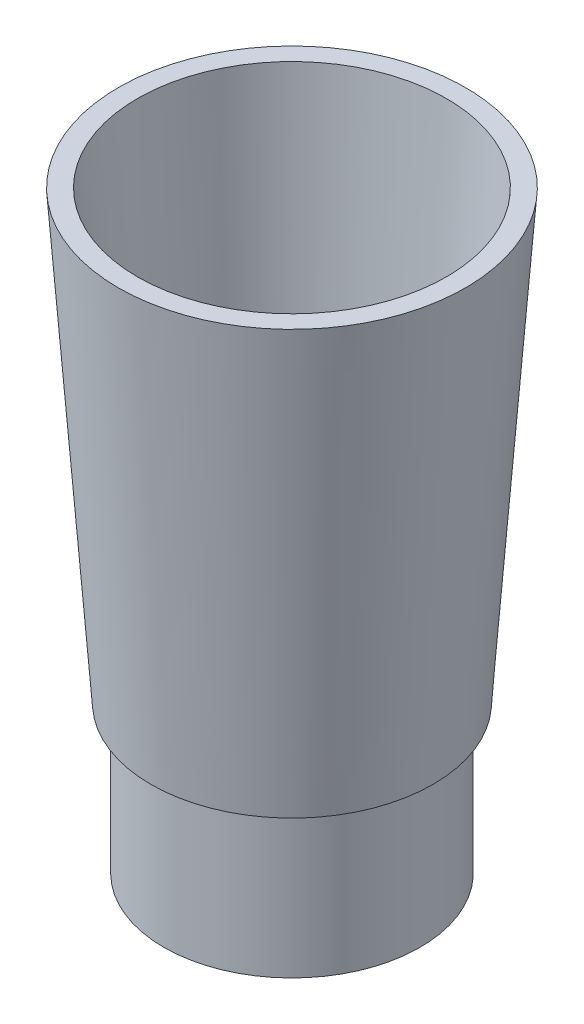
ISO-10303-21;
HEADER;
FILE_DESCRIPTION(('STEP AP214'),'2;1');
FILE_NAME('part.step','',(''),(''),'','','');
FILE_SCHEMA(('AUTOMOTIVE_DESIGN { 1 0 10303 214 1 1 1 1 }'));
ENDSEC;
DATA;
#1=APPLICATION_CONTEXT('core data for automotive mechanical design processes');
#2=APPLICATION_PROTOCOL_DEFINITION('international standard','automotive_design',2000,#1);
#3=PRODUCT_CONTEXT('',#1,'mechanical');
#4=PRODUCT('Part','Part','',(#3));
#5=PRODUCT_RELATED_PRODUCT_CATEGORY('part','',(#4));
#6=PRODUCT_DEFINITION_FORMATION('','',#4);
#7=PRODUCT_DEFINITION_CONTEXT('part definition',#1,'design');
#8=PRODUCT_DEFINITION('design','',#6,#7);
#9=PRODUCT_DEFINITION_SHAPE('','',#8);
#10=(LENGTH_UNIT() NAMED_UNIT(*) SI_UNIT(.MILLI.,.METRE.));
#11=(NAMED_UNIT(*) PLANE_ANGLE_UNIT() SI_UNIT($,.RADIAN.));
#12=(NAMED_UNIT(*) SI_UNIT($,.STERADIAN.) SOLID_ANGLE_UNIT());
#13=UNCERTAINTY_MEASURE_WITH_UNIT(LENGTH_MEASURE(1.E-05),#10,'distance_accuracy_value','');
#14=(GEOMETRIC_REPRESENTATION_CONTEXT(3) GLOBAL_UNCERTAINTY_ASSIGNED_CONTEXT((#13)) GLOBAL_UNIT_ASSIGNED_CONTEXT((#10,
#11,#12)) REPRESENTATION_CONTEXT('',''));
#15=CARTESIAN_POINT('',(0.,0.,0.));
#16=DIRECTION('',(0.,0.,1.));
#17=DIRECTION('',(1.,0.,0.));
#18=AXIS2_PLACEMENT_3D('',#15,#16,#17);
#19=CARTESIAN_POINT('',(13.5,0.,0.));
#20=DIRECTION('',(0.,1.,0.));
#21=DIRECTION('',(0.,0.,1.));
#22=AXIS2_PLACEMENT_3D('',#19,#20,#21);
#23=PLANE('',#22);
#24=CARTESIAN_POINT('',(0.,0.,0.));
#25=DIRECTION('',(0.,1.,0.));
#26=DIRECTION('',(0.,0.,1.));
#27=AXIS2_PLACEMENT_3D('',#24,#25,#26);
#28=CIRCLE('',#27,13.5);
#29=CARTESIAN_POINT('',(0.,0.,13.5));
#30=VERTEX_POINT('',#29);
#31=EDGE_CURVE('E59',#30,#30,#28,.T.);
#32=ORIENTED_EDGE('',*,*,#31,.F.);
#33=EDGE_LOOP('',(#32));
#34=FACE_BOUND('',#33,.T.);
#35=CARTESIAN_POINT('',(0.,0.,0.));
#36=DIRECTION('',(0.,1.,0.));
#37=DIRECTION('',(0.,0.,1.));
#38=AXIS2_PLACEMENT_3D('',#35,#36,#37);
#39=CIRCLE('',#38,11.5);
#40=CARTESIAN_POINT('',(0.,0.,11.5));
#41=VERTEX_POINT('',#40);
#42=EDGE_CURVE('E10',#41,#41,#39,.T.);
#43=ORIENTED_EDGE('',*,*,#42,.T.);
#44=EDGE_LOOP('',(#43));
#45=FACE_BOUND('',#44,.T.);
#46=ADVANCED_FACE('F31',(#34,#45),#23,.F.);
#47=CARTESIAN_POINT('',(0.,70.0734722806969,0.));
#48=DIRECTION('',(0.,1.,0.));
#49=DIRECTION('',(0.,0.,1.));
#50=AXIS2_PLACEMENT_3D('',#47,#48,#49);
#51=CYLINDRICAL_SURFACE('',#50,11.5);
#52=ORIENTED_EDGE('',*,*,#42,.F.);
#53=EDGE_LOOP('',(#52));
#54=FACE_BOUND('',#53,.T.);
#55=CARTESIAN_POINT('',(0.,17.5446494070987,0.));
#56=DIRECTION('',(0.,1.,0.));
#57=DIRECTION('',(0.,0.,1.));
#58=AXIS2_PLACEMENT_3D('',#55,#56,#57);
#59=CIRCLE('',#58,11.5);
#60=CARTESIAN_POINT('',(0.,17.5446494070987,11.5));
#61=VERTEX_POINT('',#60);
#62=EDGE_CURVE('E37',#61,#61,#59,.T.);
#63=ORIENTED_EDGE('',*,*,#62,.T.);
#64=EDGE_LOOP('',(#63));
#65=FACE_BOUND('',#64,.T.);
#66=ADVANCED_FACE('F66',(#54,#65),#51,.F.);
#67=CARTESIAN_POINT('',(11.5,17.5446494070987,0.));
#68=DIRECTION('',(0.,-1.,0.));
#69=DIRECTION('',(0.,0.,-1.));
#70=AXIS2_PLACEMENT_3D('',#67,#68,#69);
#71=PLANE('',#70);
#72=ORIENTED_EDGE('',*,*,#62,.F.);
#73=EDGE_LOOP('',(#72));
#74=FACE_BOUND('',#73,.T.);
#75=CARTESIAN_POINT('',(0.,17.5446494070987,0.));
#76=DIRECTION('',(0.,1.,0.));
#77=DIRECTION('',(0.,0.,1.));
#78=AXIS2_PLACEMENT_3D('',#75,#76,#77);
#79=CIRCLE('',#78,13.);
#80=CARTESIAN_POINT('',(0.,17.5446494070987,13.));
#81=VERTEX_POINT('',#80);
#82=EDGE_CURVE('E41',#81,#81,#79,.T.);
#83=ORIENTED_EDGE('',*,*,#82,.T.);
#84=EDGE_LOOP('',(#83));
#85=FACE_BOUND('',#84,.T.);
#86=ADVANCED_FACE('F70',(#74,#85),#71,.F.);
#87=CARTESIAN_POINT('',(0.,62.5446494070987,0.));
#88=DIRECTION('',(0.,1.,0.));
#89=DIRECTION('',(0.,0.,1.));
#90=AXIS2_PLACEMENT_3D('',#87,#88,#89);
#91=CONICAL_SURFACE('',#90,16.2730097006899,0.0726056968829603);
#92=ORIENTED_EDGE('',*,*,#82,.F.);
#93=EDGE_LOOP('',(#92));
#94=FACE_BOUND('',#93,.T.);
#95=CARTESIAN_POINT('',(0.,62.5446494070987,0.));
#96=DIRECTION('',(0.,1.,0.));
#97=DIRECTION('',(0.,0.,1.));
#98=AXIS2_PLACEMENT_3D('',#95,#96,#97);
#99=CIRCLE('',#98,16.2730097006899);
#100=CARTESIAN_POINT('',(0.,62.5446494070987,16.2730097006899));
#101=VERTEX_POINT('',#100);
#102=EDGE_CURVE('E45',#101,#101,#99,.T.);
#103=ORIENTED_EDGE('',*,*,#102,.T.);
#104=EDGE_LOOP('',(#103));
#105=FACE_BOUND('',#104,.T.);
#106=ADVANCED_FACE('F75',(#94,#105),#91,.F.);
#107=CARTESIAN_POINT('',(16.2730097006899,62.5446494070987,0.));
#108=DIRECTION('',(0.,-1.,0.));
#109=DIRECTION('',(0.,0.,-1.));
#110=AXIS2_PLACEMENT_3D('',#107,#108,#109);
#111=PLANE('',#110);
#112=ORIENTED_EDGE('',*,*,#102,.F.);
#113=EDGE_LOOP('',(#112));
#114=FACE_BOUND('',#113,.T.);
#115=CARTESIAN_POINT('',(0.,62.5446494070987,0.));
#116=DIRECTION('',(0.,1.,0.));
#117=DIRECTION('',(0.,0.,1.));
#118=AXIS2_PLACEMENT_3D('',#115,#116,#117);
#119=CIRCLE('',#118,18.2782928917991);
#120=CARTESIAN_POINT('',(0.,62.5446494070987,18.2782928917991));
#121=VERTEX_POINT('',#120);
#122=EDGE_CURVE('E50',#121,#121,#119,.T.);
#123=ORIENTED_EDGE('',*,*,#122,.T.);
#124=EDGE_LOOP('',(#123));
#125=FACE_BOUND('',#124,.T.);
#126=ADVANCED_FACE('F81',(#114,#125),#111,.F.);
#127=CARTESIAN_POINT('',(0.,15.5446494070987,0.));
#128=DIRECTION('',(0.,1.,0.));
#129=DIRECTION('',(0.,0.,1.));
#130=AXIS2_PLACEMENT_3D('',#127,#128,#129);
#131=CONICAL_SURFACE('',#130,14.8598160933007,0.0726056968829602);
#132=ORIENTED_EDGE('',*,*,#122,.F.);
#133=EDGE_LOOP('',(#132));
#134=FACE_BOUND('',#133,.T.);
#135=CARTESIAN_POINT('',(0.,15.5446494070987,0.));
#136=DIRECTION('',(0.,1.,0.));
#137=DIRECTION('',(0.,0.,1.));
#138=AXIS2_PLACEMENT_3D('',#135,#136,#137);
#139=CIRCLE('',#138,14.8598160933007);
#140=CARTESIAN_POINT('',(0.,15.5446494070987,14.8598160933007));
#141=VERTEX_POINT('',#140);
#142=EDGE_CURVE('E53',#141,#141,#139,.T.);
#143=ORIENTED_EDGE('',*,*,#142,.T.);
#144=EDGE_LOOP('',(#143));
#145=FACE_BOUND('',#144,.T.);
#146=ADVANCED_FACE('F85',(#134,#145),#131,.T.);
#147=CARTESIAN_POINT('',(14.8598160933007,15.5446494070987,0.));
#148=DIRECTION('',(0.,1.,0.));
#149=DIRECTION('',(0.,0.,1.));
#150=AXIS2_PLACEMENT_3D('',#147,#148,#149);
#151=PLANE('',#150);
#152=ORIENTED_EDGE('',*,*,#142,.F.);
#153=EDGE_LOOP('',(#152));
#154=FACE_BOUND('',#153,.T.);
#155=CARTESIAN_POINT('',(0.,15.5446494070987,0.));
#156=DIRECTION('',(0.,1.,0.));
#157=DIRECTION('',(0.,0.,1.));
#158=AXIS2_PLACEMENT_3D('',#155,#156,#157);
#159=CIRCLE('',#158,13.5);
#160=CARTESIAN_POINT('',(0.,15.5446494070987,13.5));
#161=VERTEX_POINT('',#160);
#162=EDGE_CURVE('E56',#161,#161,#159,.T.);
#163=ORIENTED_EDGE('',*,*,#162,.T.);
#164=EDGE_LOOP('',(#163));
#165=FACE_BOUND('',#164,.T.);
#166=ADVANCED_FACE('F89',(#154,#165),#151,.F.);
#167=CARTESIAN_POINT('',(0.,70.0734722806969,0.));
#168=DIRECTION('',(0.,1.,0.));
#169=DIRECTION('',(0.,0.,1.));
#170=AXIS2_PLACEMENT_3D('',#167,#168,#169);
#171=CYLINDRICAL_SURFACE('',#170,13.5);
#172=ORIENTED_EDGE('',*,*,#162,.F.);
#173=EDGE_LOOP('',(#172));
#174=FACE_BOUND('',#173,.T.);
#175=ORIENTED_EDGE('',*,*,#31,.T.);
#176=EDGE_LOOP('',(#175));
#177=FACE_BOUND('',#176,.T.);
#178=ADVANCED_FACE('F63',(#174,#177),#171,.T.);
#179=CLOSED_SHELL('',(#46,#66,#86,#106,#126,#146,#166,#178));
#180=MANIFOLD_SOLID_BREP('B2',#179);
#181=ADVANCED_BREP_SHAPE_REPRESENTATION('',(#18,#180),#14);
#182=SHAPE_DEFINITION_REPRESENTATION(#9,#181);
ENDSEC;
END-ISO-10303-21;
